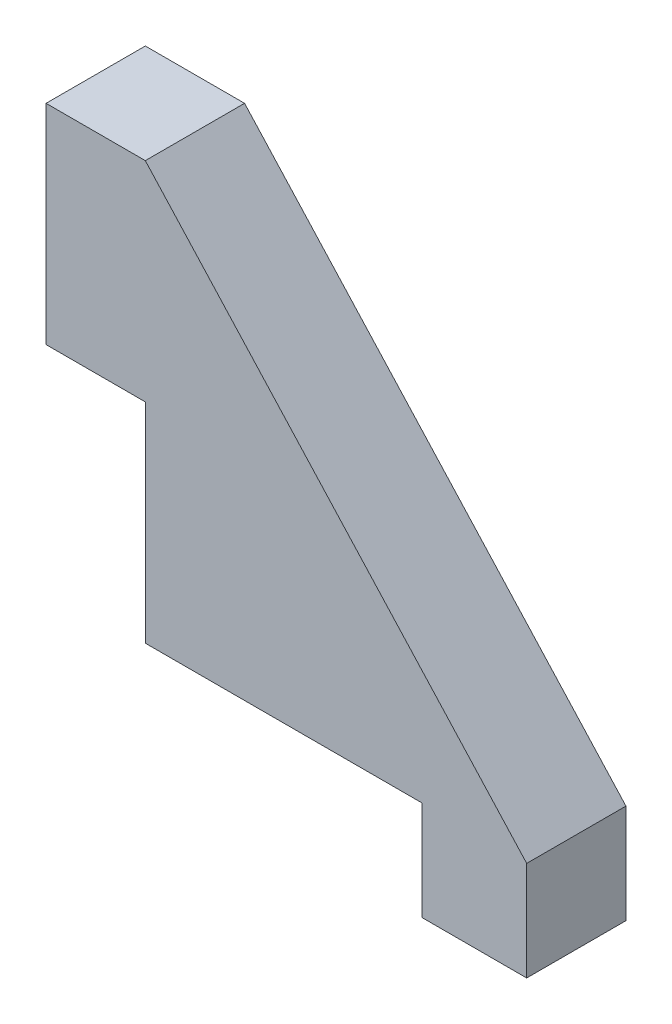
ISO-10303-21;
HEADER;
FILE_DESCRIPTION(('STEP AP214'),'2;1');
FILE_NAME('part.step','',(''),(''),'','','');
FILE_SCHEMA(('AUTOMOTIVE_DESIGN { 1 0 10303 214 1 1 1 1 }'));
ENDSEC;
DATA;
#1=APPLICATION_CONTEXT('core data for automotive mechanical design processes');
#2=APPLICATION_PROTOCOL_DEFINITION('international standard','automotive_design',2000,#1);
#3=PRODUCT_CONTEXT('',#1,'mechanical');
#4=PRODUCT('Part','Part','',(#3));
#5=PRODUCT_RELATED_PRODUCT_CATEGORY('part','',(#4));
#6=PRODUCT_DEFINITION_FORMATION('','',#4);
#7=PRODUCT_DEFINITION_CONTEXT('part definition',#1,'design');
#8=PRODUCT_DEFINITION('design','',#6,#7);
#9=PRODUCT_DEFINITION_SHAPE('','',#8);
#10=(LENGTH_UNIT() NAMED_UNIT(*) SI_UNIT(.MILLI.,.METRE.));
#11=(NAMED_UNIT(*) PLANE_ANGLE_UNIT() SI_UNIT($,.RADIAN.));
#12=(NAMED_UNIT(*) SI_UNIT($,.STERADIAN.) SOLID_ANGLE_UNIT());
#13=UNCERTAINTY_MEASURE_WITH_UNIT(LENGTH_MEASURE(1.E-05),#10,'distance_accuracy_value','');
#14=(GEOMETRIC_REPRESENTATION_CONTEXT(3) GLOBAL_UNCERTAINTY_ASSIGNED_CONTEXT((#13)) GLOBAL_UNIT_ASSIGNED_CONTEXT((#10,
#11,#12)) REPRESENTATION_CONTEXT('',''));
#15=CARTESIAN_POINT('',(0.,0.,0.));
#16=DIRECTION('',(0.,0.,1.));
#17=DIRECTION('',(1.,0.,0.));
#18=AXIS2_PLACEMENT_3D('',#15,#16,#17);
#19=CARTESIAN_POINT('',(13.25,0.,4.75));
#20=DIRECTION('',(0.,1.,0.));
#21=DIRECTION('',(-1.,0.,0.));
#22=AXIS2_PLACEMENT_3D('',#19,#20,#21);
#23=PLANE('',#22);
#24=DIRECTION('',(1.,0.,0.));
#25=VECTOR('',#24,1.);
#26=CARTESIAN_POINT('',(13.25,0.,0.));
#27=LINE('',#26,#25);
#28=CARTESIAN_POINT('',(0.,0.,0.));
#29=VERTEX_POINT('',#28);
#30=CARTESIAN_POINT('',(13.25,0.,0.));
#31=VERTEX_POINT('',#30);
#32=EDGE_CURVE('E134',#29,#31,#27,.T.);
#33=ORIENTED_EDGE('',*,*,#32,.T.);
#34=DIRECTION('',(0.,0.,-1.));
#35=VECTOR('',#34,1.);
#36=CARTESIAN_POINT('',(13.25,0.,4.75));
#37=LINE('',#36,#35);
#38=CARTESIAN_POINT('',(13.25,0.,4.75));
#39=VERTEX_POINT('',#38);
#40=EDGE_CURVE('E11',#39,#31,#37,.T.);
#41=ORIENTED_EDGE('',*,*,#40,.F.);
#42=DIRECTION('',(1.,0.,0.));
#43=VECTOR('',#42,1.);
#44=CARTESIAN_POINT('',(13.25,0.,4.75));
#45=LINE('',#44,#43);
#46=CARTESIAN_POINT('',(0.,0.,4.75));
#47=VERTEX_POINT('',#46);
#48=EDGE_CURVE('E150',#47,#39,#45,.T.);
#49=ORIENTED_EDGE('',*,*,#48,.F.);
#50=DIRECTION('',(0.,0.,-1.));
#51=VECTOR('',#50,1.);
#52=CARTESIAN_POINT('',(0.,0.,4.75));
#53=LINE('',#52,#51);
#54=EDGE_CURVE('E130',#47,#29,#53,.T.);
#55=ORIENTED_EDGE('',*,*,#54,.T.);
#56=EDGE_LOOP('',(#33,#41,#49,#55));
#57=FACE_BOUND('',#56,.T.);
#58=ADVANCED_FACE('F32',(#57),#23,.F.);
#59=CARTESIAN_POINT('',(13.25,0.,4.75));
#60=DIRECTION('',(1.,0.,0.));
#61=DIRECTION('',(0.,0.,-1.));
#62=AXIS2_PLACEMENT_3D('',#59,#60,#61);
#63=PLANE('',#62);
#64=DIRECTION('',(0.,-1.,0.));
#65=VECTOR('',#64,1.);
#66=CARTESIAN_POINT('',(13.25,0.,0.));
#67=LINE('',#66,#65);
#68=CARTESIAN_POINT('',(13.25,-4.75,0.));
#69=VERTEX_POINT('',#68);
#70=EDGE_CURVE('E137',#31,#69,#67,.T.);
#71=ORIENTED_EDGE('',*,*,#70,.T.);
#72=DIRECTION('',(0.,0.,-1.));
#73=VECTOR('',#72,1.);
#74=CARTESIAN_POINT('',(13.25,-4.75,4.75));
#75=LINE('',#74,#73);
#76=CARTESIAN_POINT('',(13.25,-4.75,4.75));
#77=VERTEX_POINT('',#76);
#78=EDGE_CURVE('E40',#77,#69,#75,.T.);
#79=ORIENTED_EDGE('',*,*,#78,.F.);
#80=DIRECTION('',(0.,-1.,0.));
#81=VECTOR('',#80,1.);
#82=CARTESIAN_POINT('',(13.25,0.,4.75));
#83=LINE('',#82,#81);
#84=EDGE_CURVE('E94',#39,#77,#83,.T.);
#85=ORIENTED_EDGE('',*,*,#84,.F.);
#86=ORIENTED_EDGE('',*,*,#40,.T.);
#87=EDGE_LOOP('',(#71,#79,#85,#86));
#88=FACE_BOUND('',#87,.T.);
#89=ADVANCED_FACE('F193',(#88),#63,.F.);
#90=CARTESIAN_POINT('',(18.25,-4.75,4.75));
#91=DIRECTION('',(0.,1.,0.));
#92=DIRECTION('',(-1.,0.,0.));
#93=AXIS2_PLACEMENT_3D('',#90,#91,#92);
#94=PLANE('',#93);
#95=DIRECTION('',(1.,0.,0.));
#96=VECTOR('',#95,1.);
#97=CARTESIAN_POINT('',(18.25,-4.75,0.));
#98=LINE('',#97,#96);
#99=CARTESIAN_POINT('',(18.25,-4.75,0.));
#100=VERTEX_POINT('',#99);
#101=EDGE_CURVE('E139',#69,#100,#98,.T.);
#102=ORIENTED_EDGE('',*,*,#101,.T.);
#103=DIRECTION('',(0.,0.,-1.));
#104=VECTOR('',#103,1.);
#105=CARTESIAN_POINT('',(18.25,-4.75,4.75));
#106=LINE('',#105,#104);
#107=CARTESIAN_POINT('',(18.25,-4.75,4.75));
#108=VERTEX_POINT('',#107);
#109=EDGE_CURVE('E160',#108,#100,#106,.T.);
#110=ORIENTED_EDGE('',*,*,#109,.F.);
#111=DIRECTION('',(1.,0.,0.));
#112=VECTOR('',#111,1.);
#113=CARTESIAN_POINT('',(18.25,-4.75,4.75));
#114=LINE('',#113,#112);
#115=EDGE_CURVE('E168',#77,#108,#114,.T.);
#116=ORIENTED_EDGE('',*,*,#115,.F.);
#117=ORIENTED_EDGE('',*,*,#78,.T.);
#118=EDGE_LOOP('',(#102,#110,#116,#117));
#119=FACE_BOUND('',#118,.T.);
#120=ADVANCED_FACE('F166',(#119),#94,.F.);
#121=CARTESIAN_POINT('',(18.25,0.,4.75));
#122=DIRECTION('',(-1.,0.,0.));
#123=DIRECTION('',(0.,0.,1.));
#124=AXIS2_PLACEMENT_3D('',#121,#122,#123);
#125=PLANE('',#124);
#126=DIRECTION('',(0.,1.,0.));
#127=VECTOR('',#126,1.);
#128=CARTESIAN_POINT('',(18.25,0.,0.));
#129=LINE('',#128,#127);
#130=CARTESIAN_POINT('',(18.25,0.,0.));
#131=VERTEX_POINT('',#130);
#132=EDGE_CURVE('E141',#100,#131,#129,.T.);
#133=ORIENTED_EDGE('',*,*,#132,.T.);
#134=DIRECTION('',(0.,0.,-1.));
#135=VECTOR('',#134,1.);
#136=CARTESIAN_POINT('',(18.25,0.,4.75));
#137=LINE('',#136,#135);
#138=CARTESIAN_POINT('',(18.25,0.,4.75));
#139=VERTEX_POINT('',#138);
#140=EDGE_CURVE('E157',#139,#131,#137,.T.);
#141=ORIENTED_EDGE('',*,*,#140,.F.);
#142=DIRECTION('',(0.,1.,0.));
#143=VECTOR('',#142,1.);
#144=CARTESIAN_POINT('',(18.25,0.,4.75));
#145=LINE('',#144,#143);
#146=EDGE_CURVE('E184',#108,#139,#145,.T.);
#147=ORIENTED_EDGE('',*,*,#146,.F.);
#148=ORIENTED_EDGE('',*,*,#109,.T.);
#149=EDGE_LOOP('',(#133,#141,#147,#148));
#150=FACE_BOUND('',#149,.T.);
#151=ADVANCED_FACE('F177',(#150),#125,.F.);
#152=CARTESIAN_POINT('',(0.,20.,4.75));
#153=DIRECTION('',(-0.738685363440212,-0.674050394139193,0.));
#154=DIRECTION('',(0.674050394139193,-0.738685363440212,0.));
#155=AXIS2_PLACEMENT_3D('',#152,#153,#154);
#156=PLANE('',#155);
#157=DIRECTION('',(-0.674050394139193,0.738685363440212,0.));
#158=VECTOR('',#157,1.);
#159=CARTESIAN_POINT('',(0.,20.,0.));
#160=LINE('',#159,#158);
#161=CARTESIAN_POINT('',(0.,20.,0.));
#162=VERTEX_POINT('',#161);
#163=EDGE_CURVE('E143',#131,#162,#160,.T.);
#164=ORIENTED_EDGE('',*,*,#163,.T.);
#165=DIRECTION('',(0.,0.,-1.));
#166=VECTOR('',#165,1.);
#167=CARTESIAN_POINT('',(0.,20.,4.75));
#168=LINE('',#167,#166);
#169=CARTESIAN_POINT('',(0.,20.,4.75));
#170=VERTEX_POINT('',#169);
#171=EDGE_CURVE('E154',#170,#162,#168,.T.);
#172=ORIENTED_EDGE('',*,*,#171,.F.);
#173=DIRECTION('',(-0.674050394139193,0.738685363440212,0.));
#174=VECTOR('',#173,1.);
#175=CARTESIAN_POINT('',(0.,20.,4.75));
#176=LINE('',#175,#174);
#177=EDGE_CURVE('E183',#139,#170,#176,.T.);
#178=ORIENTED_EDGE('',*,*,#177,.F.);
#179=ORIENTED_EDGE('',*,*,#140,.T.);
#180=EDGE_LOOP('',(#164,#172,#178,#179));
#181=FACE_BOUND('',#180,.T.);
#182=ADVANCED_FACE('F181',(#181),#156,.F.);
#183=CARTESIAN_POINT('',(0.,20.,4.75));
#184=DIRECTION('',(0.,-1.,0.));
#185=DIRECTION('',(0.,0.,-1.));
#186=AXIS2_PLACEMENT_3D('',#183,#184,#185);
#187=PLANE('',#186);
#188=DIRECTION('',(-1.,0.,0.));
#189=VECTOR('',#188,1.);
#190=CARTESIAN_POINT('',(0.,20.,0.));
#191=LINE('',#190,#189);
#192=CARTESIAN_POINT('',(-4.75,20.,0.));
#193=VERTEX_POINT('',#192);
#194=EDGE_CURVE('E145',#162,#193,#191,.T.);
#195=ORIENTED_EDGE('',*,*,#194,.T.);
#196=DIRECTION('',(0.,0.,-1.));
#197=VECTOR('',#196,1.);
#198=CARTESIAN_POINT('',(-4.75,20.,4.75));
#199=LINE('',#198,#197);
#200=CARTESIAN_POINT('',(-4.75,20.,4.75));
#201=VERTEX_POINT('',#200);
#202=EDGE_CURVE('E125',#201,#193,#199,.T.);
#203=ORIENTED_EDGE('',*,*,#202,.F.);
#204=DIRECTION('',(-1.,0.,0.));
#205=VECTOR('',#204,1.);
#206=CARTESIAN_POINT('',(0.,20.,4.75));
#207=LINE('',#206,#205);
#208=EDGE_CURVE('E116',#170,#201,#207,.T.);
#209=ORIENTED_EDGE('',*,*,#208,.F.);
#210=ORIENTED_EDGE('',*,*,#171,.T.);
#211=EDGE_LOOP('',(#195,#203,#209,#210));
#212=FACE_BOUND('',#211,.T.);
#213=ADVANCED_FACE('F205',(#212),#187,.F.);
#214=CARTESIAN_POINT('',(-4.75,20.,4.75));
#215=DIRECTION('',(1.,0.,0.));
#216=DIRECTION('',(0.,1.,0.));
#217=AXIS2_PLACEMENT_3D('',#214,#215,#216);
#218=PLANE('',#217);
#219=DIRECTION('',(0.,-1.,0.));
#220=VECTOR('',#219,1.);
#221=CARTESIAN_POINT('',(-4.75,20.,0.));
#222=LINE('',#221,#220);
#223=CARTESIAN_POINT('',(-4.75,10.,0.));
#224=VERTEX_POINT('',#223);
#225=EDGE_CURVE('E124',#193,#224,#222,.T.);
#226=ORIENTED_EDGE('',*,*,#225,.T.);
#227=DIRECTION('',(0.,0.,-1.));
#228=VECTOR('',#227,1.);
#229=CARTESIAN_POINT('',(-4.75,10.,4.75));
#230=LINE('',#229,#228);
#231=CARTESIAN_POINT('',(-4.75,10.,4.75));
#232=VERTEX_POINT('',#231);
#233=EDGE_CURVE('E121',#232,#224,#230,.T.);
#234=ORIENTED_EDGE('',*,*,#233,.F.);
#235=DIRECTION('',(0.,-1.,0.));
#236=VECTOR('',#235,1.);
#237=CARTESIAN_POINT('',(-4.75,20.,4.75));
#238=LINE('',#237,#236);
#239=EDGE_CURVE('E110',#201,#232,#238,.T.);
#240=ORIENTED_EDGE('',*,*,#239,.F.);
#241=ORIENTED_EDGE('',*,*,#202,.T.);
#242=EDGE_LOOP('',(#226,#234,#240,#241));
#243=FACE_BOUND('',#242,.T.);
#244=ADVANCED_FACE('F122',(#243),#218,.F.);
#245=CARTESIAN_POINT('',(0.,10.,4.75));
#246=DIRECTION('',(0.,1.,0.));
#247=DIRECTION('',(0.,0.,1.));
#248=AXIS2_PLACEMENT_3D('',#245,#246,#247);
#249=PLANE('',#248);
#250=DIRECTION('',(1.,0.,0.));
#251=VECTOR('',#250,1.);
#252=CARTESIAN_POINT('',(0.,10.,0.));
#253=LINE('',#252,#251);
#254=CARTESIAN_POINT('',(0.,10.,0.));
#255=VERTEX_POINT('',#254);
#256=EDGE_CURVE('E80',#224,#255,#253,.T.);
#257=ORIENTED_EDGE('',*,*,#256,.T.);
#258=DIRECTION('',(0.,0.,-1.));
#259=VECTOR('',#258,1.);
#260=CARTESIAN_POINT('',(0.,10.,4.75));
#261=LINE('',#260,#259);
#262=CARTESIAN_POINT('',(0.,10.,4.75));
#263=VERTEX_POINT('',#262);
#264=EDGE_CURVE('E126',#263,#255,#261,.T.);
#265=ORIENTED_EDGE('',*,*,#264,.F.);
#266=DIRECTION('',(1.,0.,0.));
#267=VECTOR('',#266,1.);
#268=CARTESIAN_POINT('',(0.,10.,4.75));
#269=LINE('',#268,#267);
#270=EDGE_CURVE('E114',#232,#263,#269,.T.);
#271=ORIENTED_EDGE('',*,*,#270,.F.);
#272=ORIENTED_EDGE('',*,*,#233,.T.);
#273=EDGE_LOOP('',(#257,#265,#271,#272));
#274=FACE_BOUND('',#273,.T.);
#275=ADVANCED_FACE('F128',(#274),#249,.F.);
#276=CARTESIAN_POINT('',(0.,0.,4.75));
#277=DIRECTION('',(1.,0.,0.));
#278=DIRECTION('',(0.,1.,0.));
#279=AXIS2_PLACEMENT_3D('',#276,#277,#278);
#280=PLANE('',#279);
#281=DIRECTION('',(0.,-1.,0.));
#282=VECTOR('',#281,1.);
#283=CARTESIAN_POINT('',(0.,0.,0.));
#284=LINE('',#283,#282);
#285=EDGE_CURVE('E86',#255,#29,#284,.T.);
#286=ORIENTED_EDGE('',*,*,#285,.T.);
#287=ORIENTED_EDGE('',*,*,#54,.F.);
#288=DIRECTION('',(0.,-1.,0.));
#289=VECTOR('',#288,1.);
#290=CARTESIAN_POINT('',(0.,0.,4.75));
#291=LINE('',#290,#289);
#292=EDGE_CURVE('E48',#263,#47,#291,.T.);
#293=ORIENTED_EDGE('',*,*,#292,.F.);
#294=ORIENTED_EDGE('',*,*,#264,.T.);
#295=EDGE_LOOP('',(#286,#287,#293,#294));
#296=FACE_BOUND('',#295,.T.);
#297=ADVANCED_FACE('F213',(#296),#280,.F.);
#298=CARTESIAN_POINT('',(0.,0.,4.75));
#299=DIRECTION('',(0.,0.,-1.));
#300=DIRECTION('',(-1.,0.,0.));
#301=AXIS2_PLACEMENT_3D('',#298,#299,#300);
#302=PLANE('',#301);
#303=ORIENTED_EDGE('',*,*,#48,.T.);
#304=ORIENTED_EDGE('',*,*,#84,.T.);
#305=ORIENTED_EDGE('',*,*,#115,.T.);
#306=ORIENTED_EDGE('',*,*,#146,.T.);
#307=ORIENTED_EDGE('',*,*,#177,.T.);
#308=ORIENTED_EDGE('',*,*,#208,.T.);
#309=ORIENTED_EDGE('',*,*,#239,.T.);
#310=ORIENTED_EDGE('',*,*,#270,.T.);
#311=ORIENTED_EDGE('',*,*,#292,.T.);
#312=EDGE_LOOP('',(#303,#304,#305,#306,#307,#308,#309,#310,#311));
#313=FACE_BOUND('',#312,.T.);
#314=ADVANCED_FACE('F112',(#313),#302,.F.);
#315=CARTESIAN_POINT('',(0.,0.,0.));
#316=DIRECTION('',(0.,0.,-1.));
#317=DIRECTION('',(-1.,0.,0.));
#318=AXIS2_PLACEMENT_3D('',#315,#316,#317);
#319=PLANE('',#318);
#320=ORIENTED_EDGE('',*,*,#32,.F.);
#321=ORIENTED_EDGE('',*,*,#285,.F.);
#322=ORIENTED_EDGE('',*,*,#256,.F.);
#323=ORIENTED_EDGE('',*,*,#225,.F.);
#324=ORIENTED_EDGE('',*,*,#194,.F.);
#325=ORIENTED_EDGE('',*,*,#163,.F.);
#326=ORIENTED_EDGE('',*,*,#132,.F.);
#327=ORIENTED_EDGE('',*,*,#101,.F.);
#328=ORIENTED_EDGE('',*,*,#70,.F.);
#329=EDGE_LOOP('',(#320,#321,#322,#323,#324,#325,#326,#327,#328));
#330=FACE_BOUND('',#329,.T.);
#331=ADVANCED_FACE('F172',(#330),#319,.T.);
#332=CLOSED_SHELL('',(#58,#89,#120,#151,#182,#213,#244,#275,#297,#314,#331));
#333=MANIFOLD_SOLID_BREP('B2',#332);
#334=ADVANCED_BREP_SHAPE_REPRESENTATION('',(#18,#333),#14);
#335=SHAPE_DEFINITION_REPRESENTATION(#9,#334);
ENDSEC;
END-ISO-10303-21;
